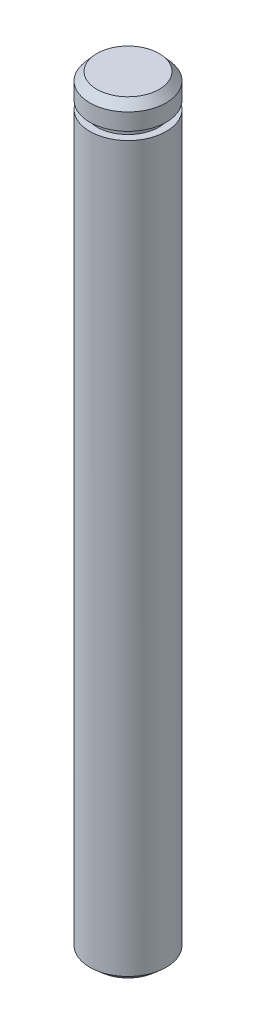
ISO-10303-21;
HEADER;
FILE_DESCRIPTION(('STEP AP214'),'2;1');
FILE_NAME('part.step','',(''),(''),'','','');
FILE_SCHEMA(('AUTOMOTIVE_DESIGN { 1 0 10303 214 1 1 1 1 }'));
ENDSEC;
DATA;
#1=APPLICATION_CONTEXT('core data for automotive mechanical design processes');
#2=APPLICATION_PROTOCOL_DEFINITION('international standard','automotive_design',2000,#1);
#3=PRODUCT_CONTEXT('',#1,'mechanical');
#4=PRODUCT('Part','Part','',(#3));
#5=PRODUCT_RELATED_PRODUCT_CATEGORY('part','',(#4));
#6=PRODUCT_DEFINITION_FORMATION('','',#4);
#7=PRODUCT_DEFINITION_CONTEXT('part definition',#1,'design');
#8=PRODUCT_DEFINITION('design','',#6,#7);
#9=PRODUCT_DEFINITION_SHAPE('','',#8);
#10=(LENGTH_UNIT() NAMED_UNIT(*) SI_UNIT(.MILLI.,.METRE.));
#11=(NAMED_UNIT(*) PLANE_ANGLE_UNIT() SI_UNIT($,.RADIAN.));
#12=(NAMED_UNIT(*) SI_UNIT($,.STERADIAN.) SOLID_ANGLE_UNIT());
#13=UNCERTAINTY_MEASURE_WITH_UNIT(LENGTH_MEASURE(1.E-05),#10,'distance_accuracy_value','');
#14=(GEOMETRIC_REPRESENTATION_CONTEXT(3) GLOBAL_UNCERTAINTY_ASSIGNED_CONTEXT((#13)) GLOBAL_UNIT_ASSIGNED_CONTEXT((#10,
#11,#12)) REPRESENTATION_CONTEXT('',''));
#15=CARTESIAN_POINT('',(0.,0.,0.));
#16=DIRECTION('',(0.,0.,1.));
#17=DIRECTION('',(1.,0.,0.));
#18=AXIS2_PLACEMENT_3D('',#15,#16,#17);
#19=CARTESIAN_POINT('',(0.,47.625,0.));
#20=DIRECTION('',(0.,-1.,0.));
#21=DIRECTION('',(0.,0.,-1.));
#22=AXIS2_PLACEMENT_3D('',#19,#20,#21);
#23=CYLINDRICAL_SURFACE('',#22,4.7625);
#24=CARTESIAN_POINT('',(0.,44.5129536646109,0.));
#25=DIRECTION('',(0.,-1.,0.));
#26=DIRECTION('',(0.,0.,-1.));
#27=AXIS2_PLACEMENT_3D('',#24,#25,#26);
#28=CIRCLE('',#27,4.76250000000007);
#29=CARTESIAN_POINT('',(0.,44.5129536646109,-4.76250000000007));
#30=VERTEX_POINT('',#29);
#31=EDGE_CURVE('E59',#30,#30,#28,.T.);
#32=ORIENTED_EDGE('',*,*,#31,.F.);
#33=EDGE_LOOP('',(#32));
#34=FACE_BOUND('',#33,.T.);
#35=CARTESIAN_POINT('',(0.,46.609,0.));
#36=DIRECTION('',(0.,1.,0.));
#37=DIRECTION('',(0.,0.,1.));
#38=AXIS2_PLACEMENT_3D('',#35,#36,#37);
#39=CIRCLE('',#38,4.7625);
#40=CARTESIAN_POINT('',(0.,46.609,4.7625));
#41=VERTEX_POINT('',#40);
#42=EDGE_CURVE('E45',#41,#41,#39,.F.);
#43=ORIENTED_EDGE('',*,*,#42,.T.);
#44=EDGE_LOOP('',(#43));
#45=FACE_BOUND('',#44,.T.);
#46=ADVANCED_FACE('F30',(#34,#45),#23,.T.);
#47=CARTESIAN_POINT('',(0.,47.625,0.));
#48=DIRECTION('',(0.,1.,0.));
#49=DIRECTION('',(0.,0.,1.));
#50=AXIS2_PLACEMENT_3D('',#47,#48,#49);
#51=PLANE('',#50);
#52=CARTESIAN_POINT('',(0.,47.625,0.));
#53=DIRECTION('',(0.,1.,0.));
#54=DIRECTION('',(0.,0.,1.));
#55=AXIS2_PLACEMENT_3D('',#52,#53,#54);
#56=CIRCLE('',#55,3.87930467437873);
#57=CARTESIAN_POINT('',(0.,47.625,3.87930467437873));
#58=VERTEX_POINT('',#57);
#59=EDGE_CURVE('E10',#58,#58,#56,.T.);
#60=ORIENTED_EDGE('',*,*,#59,.T.);
#61=EDGE_LOOP('',(#60));
#62=FACE_BOUND('',#61,.T.);
#63=ADVANCED_FACE('F67',(#62),#51,.T.);
#64=CARTESIAN_POINT('',(0.,47.625,0.));
#65=DIRECTION('',(0.,-1.,0.));
#66=DIRECTION('',(0.,0.,-1.));
#67=AXIS2_PLACEMENT_3D('',#64,#65,#66);
#68=CONICAL_SURFACE('',#67,3.87930467437873,0.715584993317673);
#69=ORIENTED_EDGE('',*,*,#42,.F.);
#70=EDGE_LOOP('',(#69));
#71=FACE_BOUND('',#70,.T.);
#72=ORIENTED_EDGE('',*,*,#59,.F.);
#73=EDGE_LOOP('',(#72));
#74=FACE_BOUND('',#73,.T.);
#75=ADVANCED_FACE('F32',(#71,#74),#68,.T.);
#76=CARTESIAN_POINT('',(0.,44.5129536646109,0.));
#77=DIRECTION('',(0.,1.,0.));
#78=DIRECTION('',(0.,0.,1.));
#79=AXIS2_PLACEMENT_3D('',#76,#77,#78);
#80=PLANE('',#79);
#81=CARTESIAN_POINT('',(0.,44.5129536646109,0.));
#82=DIRECTION('',(0.,-1.,0.));
#83=DIRECTION('',(0.,0.,-1.));
#84=AXIS2_PLACEMENT_3D('',#81,#82,#83);
#85=CIRCLE('',#84,3.84810000000007);
#86=CARTESIAN_POINT('',(0.,44.5129536646109,-3.84810000000007));
#87=VERTEX_POINT('',#86);
#88=EDGE_CURVE('E50',#87,#87,#85,.T.);
#89=ORIENTED_EDGE('',*,*,#88,.F.);
#90=EDGE_LOOP('',(#89));
#91=FACE_BOUND('',#90,.T.);
#92=ORIENTED_EDGE('',*,*,#31,.T.);
#93=EDGE_LOOP('',(#92));
#94=FACE_BOUND('',#93,.T.);
#95=ADVANCED_FACE('F63',(#91,#94),#80,.F.);
#96=CARTESIAN_POINT('',(0.,-47.8207583389896,0.));
#97=DIRECTION('',(0.,-1.,0.));
#98=DIRECTION('',(0.,0.,-1.));
#99=AXIS2_PLACEMENT_3D('',#96,#97,#98);
#100=CYLINDRICAL_SURFACE('',#99,3.84810000000006);
#101=CARTESIAN_POINT('',(0.,43.5223536646109,0.));
#102=DIRECTION('',(0.,-1.,0.));
#103=DIRECTION('',(0.,0.,-1.));
#104=AXIS2_PLACEMENT_3D('',#101,#102,#103);
#105=CIRCLE('',#104,3.84810000000006);
#106=CARTESIAN_POINT('',(0.,43.5223536646109,-3.84810000000006));
#107=VERTEX_POINT('',#106);
#108=EDGE_CURVE('E53',#107,#107,#105,.T.);
#109=ORIENTED_EDGE('',*,*,#108,.F.);
#110=EDGE_LOOP('',(#109));
#111=FACE_BOUND('',#110,.T.);
#112=ORIENTED_EDGE('',*,*,#88,.T.);
#113=EDGE_LOOP('',(#112));
#114=FACE_BOUND('',#113,.T.);
#115=ADVANCED_FACE('F78',(#111,#114),#100,.T.);
#116=CARTESIAN_POINT('',(0.,43.5223536646109,0.));
#117=DIRECTION('',(0.,1.,0.));
#118=DIRECTION('',(0.,0.,1.));
#119=AXIS2_PLACEMENT_3D('',#116,#117,#118);
#120=PLANE('',#119);
#121=ORIENTED_EDGE('',*,*,#108,.T.);
#122=EDGE_LOOP('',(#121));
#123=FACE_BOUND('',#122,.T.);
#124=CARTESIAN_POINT('',(0.,43.5223536646109,0.));
#125=DIRECTION('',(0.,-1.,0.));
#126=DIRECTION('',(0.,0.,-1.));
#127=AXIS2_PLACEMENT_3D('',#124,#125,#126);
#128=CIRCLE('',#127,4.76250000000006);
#129=CARTESIAN_POINT('',(0.,43.5223536646109,-4.76250000000006));
#130=VERTEX_POINT('',#129);
#131=EDGE_CURVE('E56',#130,#130,#128,.T.);
#132=ORIENTED_EDGE('',*,*,#131,.F.);
#133=EDGE_LOOP('',(#132));
#134=FACE_BOUND('',#133,.T.);
#135=ADVANCED_FACE('F89',(#123,#134),#120,.T.);
#136=CARTESIAN_POINT('',(0.,-47.625,0.));
#137=DIRECTION('',(0.,1.,0.));
#138=DIRECTION('',(0.,0.,1.));
#139=AXIS2_PLACEMENT_3D('',#136,#137,#138);
#140=PLANE('',#139);
#141=CARTESIAN_POINT('',(0.,-47.625,0.));
#142=DIRECTION('',(0.,1.,0.));
#143=DIRECTION('',(0.,0.,1.));
#144=AXIS2_PLACEMENT_3D('',#141,#142,#143);
#145=CIRCLE('',#144,3.74649999999999);
#146=CARTESIAN_POINT('',(0.,-47.625,3.74649999999999));
#147=VERTEX_POINT('',#146);
#148=EDGE_CURVE('E37',#147,#147,#145,.F.);
#149=ORIENTED_EDGE('',*,*,#148,.T.);
#150=EDGE_LOOP('',(#149));
#151=FACE_BOUND('',#150,.T.);
#152=ADVANCED_FACE('F86',(#151),#140,.F.);
#153=CARTESIAN_POINT('',(0.,-46.7418046743787,0.));
#154=DIRECTION('',(0.,1.,0.));
#155=DIRECTION('',(0.,0.,1.));
#156=AXIS2_PLACEMENT_3D('',#153,#154,#155);
#157=CONICAL_SURFACE('',#156,4.7625,0.855211333477215);
#158=ORIENTED_EDGE('',*,*,#148,.F.);
#159=EDGE_LOOP('',(#158));
#160=FACE_BOUND('',#159,.T.);
#161=CARTESIAN_POINT('',(0.,-46.7418046743787,0.));
#162=DIRECTION('',(0.,1.,0.));
#163=DIRECTION('',(0.,0.,1.));
#164=AXIS2_PLACEMENT_3D('',#161,#162,#163);
#165=CIRCLE('',#164,4.7625);
#166=CARTESIAN_POINT('',(0.,-46.7418046743787,4.7625));
#167=VERTEX_POINT('',#166);
#168=EDGE_CURVE('E41',#167,#167,#165,.T.);
#169=ORIENTED_EDGE('',*,*,#168,.F.);
#170=EDGE_LOOP('',(#169));
#171=FACE_BOUND('',#170,.T.);
#172=ADVANCED_FACE('F88',(#160,#171),#157,.T.);
#173=ORIENTED_EDGE('',*,*,#168,.T.);
#174=EDGE_LOOP('',(#173));
#175=FACE_BOUND('',#174,.T.);
#176=ORIENTED_EDGE('',*,*,#131,.T.);
#177=EDGE_LOOP('',(#176));
#178=FACE_BOUND('',#177,.T.);
#179=ADVANCED_FACE('F69',(#175,#178),#23,.T.);
#180=CLOSED_SHELL('',(#46,#63,#75,#95,#115,#135,#152,#172,#179));
#181=MANIFOLD_SOLID_BREP('B2',#180);
#182=ADVANCED_BREP_SHAPE_REPRESENTATION('',(#18,#181),#14);
#183=SHAPE_DEFINITION_REPRESENTATION(#9,#182);
ENDSEC;
END-ISO-10303-21;
